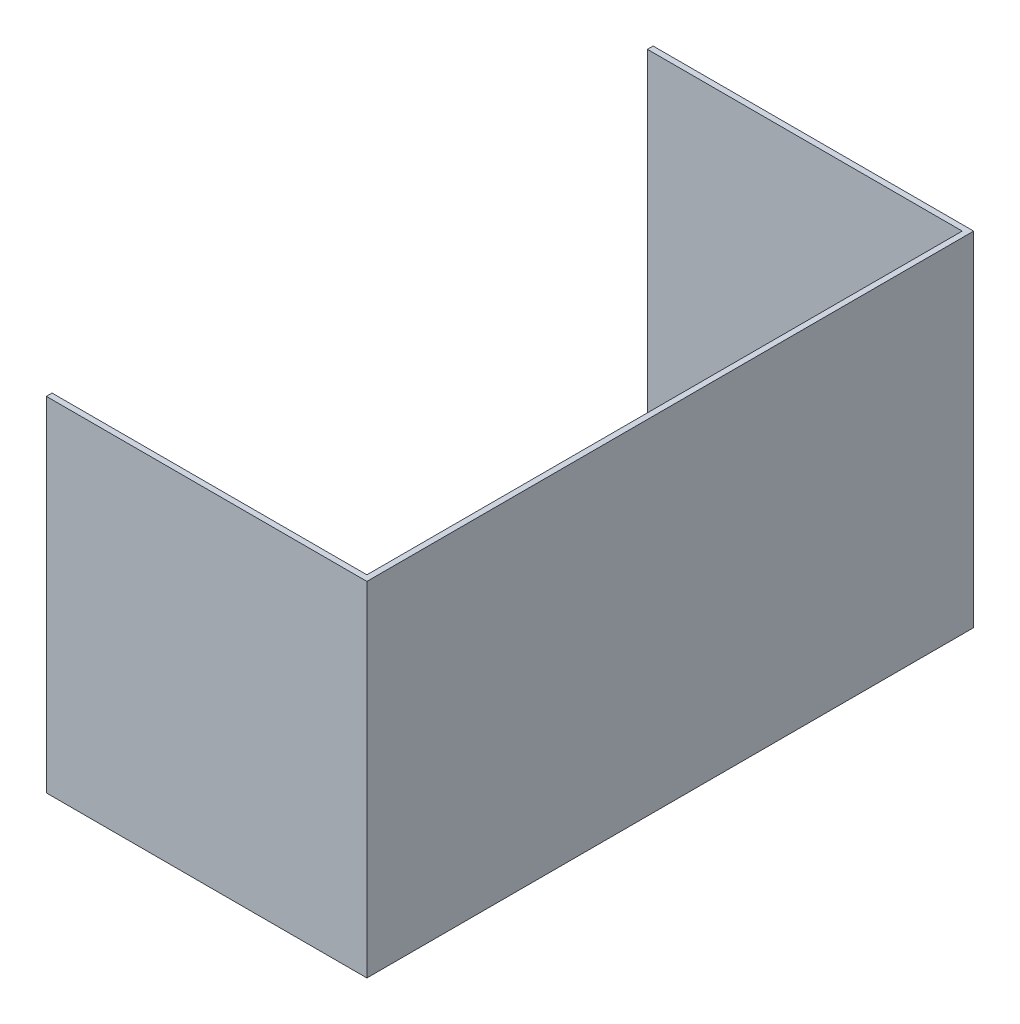
ISO-10303-21;
HEADER;
FILE_DESCRIPTION(('STEP AP214'),'2;1');
FILE_NAME('part.step','',(''),(''),'','','');
FILE_SCHEMA(('AUTOMOTIVE_DESIGN { 1 0 10303 214 1 1 1 1 }'));
ENDSEC;
DATA;
#1=APPLICATION_CONTEXT('core data for automotive mechanical design processes');
#2=APPLICATION_PROTOCOL_DEFINITION('international standard','automotive_design',2000,#1);
#3=PRODUCT_CONTEXT('',#1,'mechanical');
#4=PRODUCT('Part','Part','',(#3));
#5=PRODUCT_RELATED_PRODUCT_CATEGORY('part','',(#4));
#6=PRODUCT_DEFINITION_FORMATION('','',#4);
#7=PRODUCT_DEFINITION_CONTEXT('part definition',#1,'design');
#8=PRODUCT_DEFINITION('design','',#6,#7);
#9=PRODUCT_DEFINITION_SHAPE('','',#8);
#10=(LENGTH_UNIT() NAMED_UNIT(*) SI_UNIT(.MILLI.,.METRE.));
#11=(NAMED_UNIT(*) PLANE_ANGLE_UNIT() SI_UNIT($,.RADIAN.));
#12=(NAMED_UNIT(*) SI_UNIT($,.STERADIAN.) SOLID_ANGLE_UNIT());
#13=UNCERTAINTY_MEASURE_WITH_UNIT(LENGTH_MEASURE(1.E-05),#10,'distance_accuracy_value','');
#14=(GEOMETRIC_REPRESENTATION_CONTEXT(3) GLOBAL_UNCERTAINTY_ASSIGNED_CONTEXT((#13)) GLOBAL_UNIT_ASSIGNED_CONTEXT((#10,
#11,#12)) REPRESENTATION_CONTEXT('',''));
#15=CARTESIAN_POINT('',(0.,0.,0.));
#16=DIRECTION('',(0.,0.,1.));
#17=DIRECTION('',(1.,0.,0.));
#18=AXIS2_PLACEMENT_3D('',#15,#16,#17);
#19=CARTESIAN_POINT('',(0.,381.,0.));
#20=DIRECTION('',(-1.,0.,0.));
#21=DIRECTION('',(0.,0.,1.));
#22=AXIS2_PLACEMENT_3D('',#19,#20,#21);
#23=PLANE('',#22);
#24=DIRECTION('',(0.,0.,-1.));
#25=VECTOR('',#24,1.);
#26=CARTESIAN_POINT('',(0.,0.,0.));
#27=LINE('',#26,#25);
#28=CARTESIAN_POINT('',(0.,0.,0.));
#29=VERTEX_POINT('',#28);
#30=CARTESIAN_POINT('',(0.,0.,-673.1));
#31=VERTEX_POINT('',#30);
#32=EDGE_CURVE('E146',#29,#31,#27,.T.);
#33=ORIENTED_EDGE('',*,*,#32,.T.);
#34=DIRECTION('',(0.,-1.,0.));
#35=VECTOR('',#34,1.);
#36=CARTESIAN_POINT('',(0.,381.,-673.1));
#37=LINE('',#36,#35);
#38=CARTESIAN_POINT('',(0.,381.,-673.1));
#39=VERTEX_POINT('',#38);
#40=EDGE_CURVE('E11',#39,#31,#37,.T.);
#41=ORIENTED_EDGE('',*,*,#40,.F.);
#42=DIRECTION('',(0.,0.,-1.));
#43=VECTOR('',#42,1.);
#44=CARTESIAN_POINT('',(0.,381.,0.));
#45=LINE('',#44,#43);
#46=CARTESIAN_POINT('',(0.,381.,0.));
#47=VERTEX_POINT('',#46);
#48=EDGE_CURVE('E168',#47,#39,#45,.T.);
#49=ORIENTED_EDGE('',*,*,#48,.F.);
#50=DIRECTION('',(0.,-1.,0.));
#51=VECTOR('',#50,1.);
#52=CARTESIAN_POINT('',(0.,381.,0.));
#53=LINE('',#52,#51);
#54=EDGE_CURVE('E142',#47,#29,#53,.T.);
#55=ORIENTED_EDGE('',*,*,#54,.T.);
#56=EDGE_LOOP('',(#33,#41,#49,#55));
#57=FACE_BOUND('',#56,.T.);
#58=ADVANCED_FACE('F45',(#57),#23,.F.);
#59=CARTESIAN_POINT('',(0.,381.,-673.1));
#60=DIRECTION('',(0.,0.,1.));
#61=DIRECTION('',(1.,0.,0.));
#62=AXIS2_PLACEMENT_3D('',#59,#60,#61);
#63=PLANE('',#62);
#64=DIRECTION('',(-1.,0.,0.));
#65=VECTOR('',#64,1.);
#66=CARTESIAN_POINT('',(0.,0.,-673.1));
#67=LINE('',#66,#65);
#68=CARTESIAN_POINT('',(-355.6,0.,-673.1));
#69=VERTEX_POINT('',#68);
#70=EDGE_CURVE('E150',#31,#69,#67,.T.);
#71=ORIENTED_EDGE('',*,*,#70,.T.);
#72=DIRECTION('',(0.,-1.,0.));
#73=VECTOR('',#72,1.);
#74=CARTESIAN_POINT('',(-355.6,381.,-673.1));
#75=LINE('',#74,#73);
#76=CARTESIAN_POINT('',(-355.6,381.,-673.1));
#77=VERTEX_POINT('',#76);
#78=EDGE_CURVE('E54',#77,#69,#75,.T.);
#79=ORIENTED_EDGE('',*,*,#78,.F.);
#80=DIRECTION('',(-1.,0.,0.));
#81=VECTOR('',#80,1.);
#82=CARTESIAN_POINT('',(0.,381.,-673.1));
#83=LINE('',#82,#81);
#84=EDGE_CURVE('E105',#39,#77,#83,.T.);
#85=ORIENTED_EDGE('',*,*,#84,.F.);
#86=ORIENTED_EDGE('',*,*,#40,.T.);
#87=EDGE_LOOP('',(#71,#79,#85,#86));
#88=FACE_BOUND('',#87,.T.);
#89=ADVANCED_FACE('F214',(#88),#63,.F.);
#90=CARTESIAN_POINT('',(-355.6,381.,-666.75));
#91=DIRECTION('',(1.,0.,0.));
#92=DIRECTION('',(0.,0.,-1.));
#93=AXIS2_PLACEMENT_3D('',#90,#91,#92);
#94=PLANE('',#93);
#95=DIRECTION('',(0.,0.,1.));
#96=VECTOR('',#95,1.);
#97=CARTESIAN_POINT('',(-355.6,0.,-666.75));
#98=LINE('',#97,#96);
#99=CARTESIAN_POINT('',(-355.6,0.,-666.75));
#100=VERTEX_POINT('',#99);
#101=EDGE_CURVE('E153',#69,#100,#98,.T.);
#102=ORIENTED_EDGE('',*,*,#101,.T.);
#103=DIRECTION('',(0.,-1.,0.));
#104=VECTOR('',#103,1.);
#105=CARTESIAN_POINT('',(-355.6,381.,-666.75));
#106=LINE('',#105,#104);
#107=CARTESIAN_POINT('',(-355.6,381.,-666.75));
#108=VERTEX_POINT('',#107);
#109=EDGE_CURVE('E179',#108,#100,#106,.T.);
#110=ORIENTED_EDGE('',*,*,#109,.F.);
#111=DIRECTION('',(0.,0.,1.));
#112=VECTOR('',#111,1.);
#113=CARTESIAN_POINT('',(-355.6,381.,-666.75));
#114=LINE('',#113,#112);
#115=EDGE_CURVE('E189',#77,#108,#114,.T.);
#116=ORIENTED_EDGE('',*,*,#115,.F.);
#117=ORIENTED_EDGE('',*,*,#78,.T.);
#118=EDGE_LOOP('',(#102,#110,#116,#117));
#119=FACE_BOUND('',#118,.T.);
#120=ADVANCED_FACE('F187',(#119),#94,.F.);
#121=CARTESIAN_POINT('',(-6.35,381.,-666.75));
#122=DIRECTION('',(0.,0.,-1.));
#123=DIRECTION('',(-1.,0.,0.));
#124=AXIS2_PLACEMENT_3D('',#121,#122,#123);
#125=PLANE('',#124);
#126=DIRECTION('',(1.,0.,0.));
#127=VECTOR('',#126,1.);
#128=CARTESIAN_POINT('',(-6.35,0.,-666.75));
#129=LINE('',#128,#127);
#130=CARTESIAN_POINT('',(-6.35,0.,-666.75));
#131=VERTEX_POINT('',#130);
#132=EDGE_CURVE('E156',#100,#131,#129,.T.);
#133=ORIENTED_EDGE('',*,*,#132,.T.);
#134=DIRECTION('',(0.,-1.,0.));
#135=VECTOR('',#134,1.);
#136=CARTESIAN_POINT('',(-6.35,381.,-666.75));
#137=LINE('',#136,#135);
#138=CARTESIAN_POINT('',(-6.35,381.,-666.75));
#139=VERTEX_POINT('',#138);
#140=EDGE_CURVE('E175',#139,#131,#137,.T.);
#141=ORIENTED_EDGE('',*,*,#140,.F.);
#142=DIRECTION('',(1.,0.,0.));
#143=VECTOR('',#142,1.);
#144=CARTESIAN_POINT('',(-6.35,381.,-666.75));
#145=LINE('',#144,#143);
#146=EDGE_CURVE('E202',#108,#139,#145,.T.);
#147=ORIENTED_EDGE('',*,*,#146,.F.);
#148=ORIENTED_EDGE('',*,*,#109,.T.);
#149=EDGE_LOOP('',(#133,#141,#147,#148));
#150=FACE_BOUND('',#149,.T.);
#151=ADVANCED_FACE('F197',(#150),#125,.F.);
#152=CARTESIAN_POINT('',(-6.35,381.,-6.35));
#153=DIRECTION('',(1.,0.,0.));
#154=DIRECTION('',(0.,0.,-1.));
#155=AXIS2_PLACEMENT_3D('',#152,#153,#154);
#156=PLANE('',#155);
#157=DIRECTION('',(0.,0.,1.));
#158=VECTOR('',#157,1.);
#159=CARTESIAN_POINT('',(-6.35,0.,-6.35));
#160=LINE('',#159,#158);
#161=CARTESIAN_POINT('',(-6.35,0.,-6.35));
#162=VERTEX_POINT('',#161);
#163=EDGE_CURVE('E159',#131,#162,#160,.T.);
#164=ORIENTED_EDGE('',*,*,#163,.T.);
#165=DIRECTION('',(0.,-1.,0.));
#166=VECTOR('',#165,1.);
#167=CARTESIAN_POINT('',(-6.35,381.,-6.35));
#168=LINE('',#167,#166);
#169=CARTESIAN_POINT('',(-6.35,381.,-6.35));
#170=VERTEX_POINT('',#169);
#171=EDGE_CURVE('E135',#170,#162,#168,.T.);
#172=ORIENTED_EDGE('',*,*,#171,.F.);
#173=DIRECTION('',(0.,0.,1.));
#174=VECTOR('',#173,1.);
#175=CARTESIAN_POINT('',(-6.35,381.,-6.35));
#176=LINE('',#175,#174);
#177=EDGE_CURVE('E124',#139,#170,#176,.T.);
#178=ORIENTED_EDGE('',*,*,#177,.F.);
#179=ORIENTED_EDGE('',*,*,#140,.T.);
#180=EDGE_LOOP('',(#164,#172,#178,#179));
#181=FACE_BOUND('',#180,.T.);
#182=ADVANCED_FACE('F200',(#181),#156,.F.);
#183=CARTESIAN_POINT('',(-6.35,381.,-6.35));
#184=DIRECTION('',(0.,0.,1.));
#185=DIRECTION('',(1.,0.,0.));
#186=AXIS2_PLACEMENT_3D('',#183,#184,#185);
#187=PLANE('',#186);
#188=DIRECTION('',(-1.,0.,0.));
#189=VECTOR('',#188,1.);
#190=CARTESIAN_POINT('',(-6.35,0.,-6.35));
#191=LINE('',#190,#189);
#192=CARTESIAN_POINT('',(-355.6,0.,-6.34999999999996));
#193=VERTEX_POINT('',#192);
#194=EDGE_CURVE('E133',#162,#193,#191,.T.);
#195=ORIENTED_EDGE('',*,*,#194,.T.);
#196=DIRECTION('',(0.,-1.,0.));
#197=VECTOR('',#196,1.);
#198=CARTESIAN_POINT('',(-355.6,381.,-6.34999999999996));
#199=LINE('',#198,#197);
#200=CARTESIAN_POINT('',(-355.6,381.,-6.34999999999996));
#201=VERTEX_POINT('',#200);
#202=EDGE_CURVE('E130',#201,#193,#199,.T.);
#203=ORIENTED_EDGE('',*,*,#202,.F.);
#204=DIRECTION('',(-1.,0.,0.));
#205=VECTOR('',#204,1.);
#206=CARTESIAN_POINT('',(-6.35,381.,-6.35));
#207=LINE('',#206,#205);
#208=EDGE_CURVE('E118',#170,#201,#207,.T.);
#209=ORIENTED_EDGE('',*,*,#208,.F.);
#210=ORIENTED_EDGE('',*,*,#171,.T.);
#211=EDGE_LOOP('',(#195,#203,#209,#210));
#212=FACE_BOUND('',#211,.T.);
#213=ADVANCED_FACE('F131',(#212),#187,.F.);
#214=CARTESIAN_POINT('',(-355.6,381.,0.));
#215=DIRECTION('',(1.,0.,0.));
#216=DIRECTION('',(0.,0.,-1.));
#217=AXIS2_PLACEMENT_3D('',#214,#215,#216);
#218=PLANE('',#217);
#219=DIRECTION('',(0.,0.,1.));
#220=VECTOR('',#219,1.);
#221=CARTESIAN_POINT('',(-355.6,0.,0.));
#222=LINE('',#221,#220);
#223=CARTESIAN_POINT('',(-355.6,0.,0.));
#224=VERTEX_POINT('',#223);
#225=EDGE_CURVE('E91',#193,#224,#222,.T.);
#226=ORIENTED_EDGE('',*,*,#225,.T.);
#227=DIRECTION('',(0.,-1.,0.));
#228=VECTOR('',#227,1.);
#229=CARTESIAN_POINT('',(-355.6,381.,0.));
#230=LINE('',#229,#228);
#231=CARTESIAN_POINT('',(-355.6,381.,0.));
#232=VERTEX_POINT('',#231);
#233=EDGE_CURVE('E136',#232,#224,#230,.T.);
#234=ORIENTED_EDGE('',*,*,#233,.F.);
#235=DIRECTION('',(0.,0.,1.));
#236=VECTOR('',#235,1.);
#237=CARTESIAN_POINT('',(-355.6,381.,0.));
#238=LINE('',#237,#236);
#239=EDGE_CURVE('E122',#201,#232,#238,.T.);
#240=ORIENTED_EDGE('',*,*,#239,.F.);
#241=ORIENTED_EDGE('',*,*,#202,.T.);
#242=EDGE_LOOP('',(#226,#234,#240,#241));
#243=FACE_BOUND('',#242,.T.);
#244=ADVANCED_FACE('F138',(#243),#218,.F.);
#245=CARTESIAN_POINT('',(0.,381.,0.));
#246=DIRECTION('',(0.,0.,-1.));
#247=DIRECTION('',(-1.,0.,0.));
#248=AXIS2_PLACEMENT_3D('',#245,#246,#247);
#249=PLANE('',#248);
#250=DIRECTION('',(1.,0.,0.));
#251=VECTOR('',#250,1.);
#252=CARTESIAN_POINT('',(0.,0.,0.));
#253=LINE('',#252,#251);
#254=EDGE_CURVE('E97',#224,#29,#253,.T.);
#255=ORIENTED_EDGE('',*,*,#254,.T.);
#256=ORIENTED_EDGE('',*,*,#54,.F.);
#257=DIRECTION('',(1.,0.,0.));
#258=VECTOR('',#257,1.);
#259=CARTESIAN_POINT('',(0.,381.,0.));
#260=LINE('',#259,#258);
#261=EDGE_CURVE('E62',#232,#47,#260,.T.);
#262=ORIENTED_EDGE('',*,*,#261,.F.);
#263=ORIENTED_EDGE('',*,*,#233,.T.);
#264=EDGE_LOOP('',(#255,#256,#262,#263));
#265=FACE_BOUND('',#264,.T.);
#266=ADVANCED_FACE('F230',(#265),#249,.F.);
#267=CARTESIAN_POINT('',(0.,381.,0.));
#268=DIRECTION('',(0.,1.,0.));
#269=DIRECTION('',(0.,0.,1.));
#270=AXIS2_PLACEMENT_3D('',#267,#268,#269);
#271=PLANE('',#270);
#272=ORIENTED_EDGE('',*,*,#48,.T.);
#273=ORIENTED_EDGE('',*,*,#84,.T.);
#274=ORIENTED_EDGE('',*,*,#115,.T.);
#275=ORIENTED_EDGE('',*,*,#146,.T.);
#276=ORIENTED_EDGE('',*,*,#177,.T.);
#277=ORIENTED_EDGE('',*,*,#208,.T.);
#278=ORIENTED_EDGE('',*,*,#239,.T.);
#279=ORIENTED_EDGE('',*,*,#261,.T.);
#280=EDGE_LOOP('',(#272,#273,#274,#275,#276,#277,#278,#279));
#281=FACE_BOUND('',#280,.T.);
#282=ADVANCED_FACE('F120',(#281),#271,.T.);
#283=CARTESIAN_POINT('',(0.,0.,0.));
#284=DIRECTION('',(0.,1.,0.));
#285=DIRECTION('',(0.,0.,1.));
#286=AXIS2_PLACEMENT_3D('',#283,#284,#285);
#287=PLANE('',#286);
#288=ORIENTED_EDGE('',*,*,#32,.F.);
#289=ORIENTED_EDGE('',*,*,#254,.F.);
#290=ORIENTED_EDGE('',*,*,#225,.F.);
#291=ORIENTED_EDGE('',*,*,#194,.F.);
#292=ORIENTED_EDGE('',*,*,#163,.F.);
#293=ORIENTED_EDGE('',*,*,#132,.F.);
#294=ORIENTED_EDGE('',*,*,#101,.F.);
#295=ORIENTED_EDGE('',*,*,#70,.F.);
#296=EDGE_LOOP('',(#288,#289,#290,#291,#292,#293,#294,#295));
#297=FACE_BOUND('',#296,.T.);
#298=ADVANCED_FACE('F193',(#297),#287,.F.);
#299=CLOSED_SHELL('',(#58,#89,#120,#151,#182,#213,#244,#266,#282,#298));
#300=MANIFOLD_SOLID_BREP('B2',#299);
#301=ADVANCED_BREP_SHAPE_REPRESENTATION('',(#18,#300),#14);
#302=SHAPE_DEFINITION_REPRESENTATION(#9,#301);
ENDSEC;
END-ISO-10303-21;
